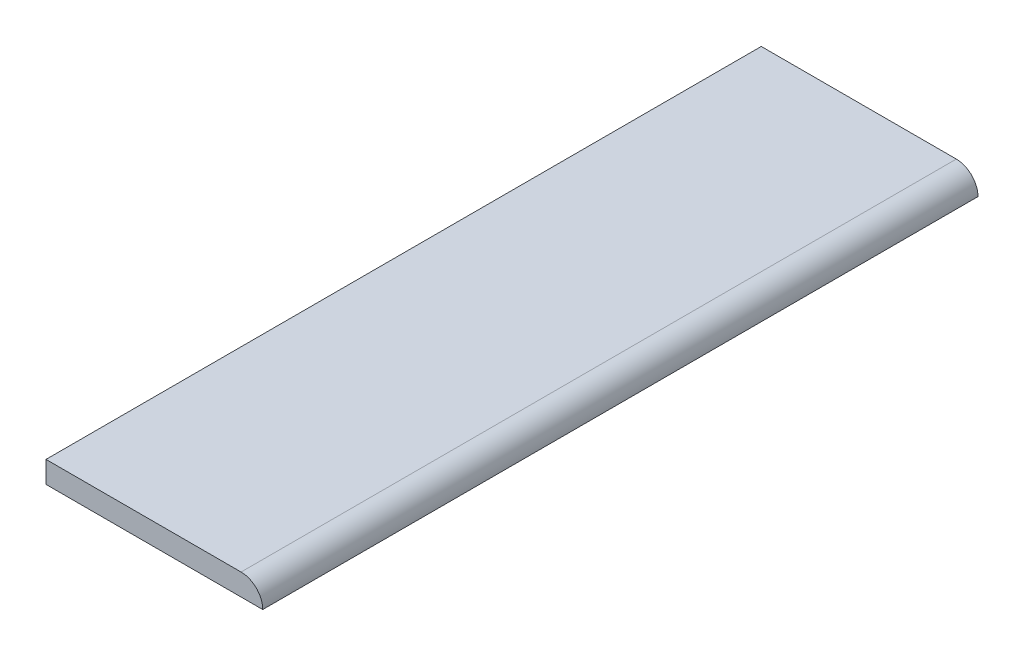
ISO-10303-21;
HEADER;
FILE_DESCRIPTION(('STEP AP214'),'2;1');
FILE_NAME('part.step','',(''),(''),'','','');
FILE_SCHEMA(('AUTOMOTIVE_DESIGN { 1 0 10303 214 1 1 1 1 }'));
ENDSEC;
DATA;
#1=APPLICATION_CONTEXT('core data for automotive mechanical design processes');
#2=APPLICATION_PROTOCOL_DEFINITION('international standard','automotive_design',2000,#1);
#3=PRODUCT_CONTEXT('',#1,'mechanical');
#4=PRODUCT('Part','Part','',(#3));
#5=PRODUCT_RELATED_PRODUCT_CATEGORY('part','',(#4));
#6=PRODUCT_DEFINITION_FORMATION('','',#4);
#7=PRODUCT_DEFINITION_CONTEXT('part definition',#1,'design');
#8=PRODUCT_DEFINITION('design','',#6,#7);
#9=PRODUCT_DEFINITION_SHAPE('','',#8);
#10=(LENGTH_UNIT() NAMED_UNIT(*) SI_UNIT(.MILLI.,.METRE.));
#11=(NAMED_UNIT(*) PLANE_ANGLE_UNIT() SI_UNIT($,.RADIAN.));
#12=(NAMED_UNIT(*) SI_UNIT($,.STERADIAN.) SOLID_ANGLE_UNIT());
#13=UNCERTAINTY_MEASURE_WITH_UNIT(LENGTH_MEASURE(1.E-05),#10,'distance_accuracy_value','');
#14=(GEOMETRIC_REPRESENTATION_CONTEXT(3) GLOBAL_UNCERTAINTY_ASSIGNED_CONTEXT((#13)) GLOBAL_UNIT_ASSIGNED_CONTEXT((#10,
#11,#12)) REPRESENTATION_CONTEXT('',''));
#15=CARTESIAN_POINT('',(0.,0.,0.));
#16=DIRECTION('',(0.,0.,1.));
#17=DIRECTION('',(1.,0.,0.));
#18=AXIS2_PLACEMENT_3D('',#15,#16,#17);
#19=CARTESIAN_POINT('',(29.29,1.62,4.05));
#20=DIRECTION('',(0.,1.,0.));
#21=DIRECTION('',(0.,0.,1.));
#22=AXIS2_PLACEMENT_3D('',#19,#20,#21);
#23=PLANE('',#22);
#24=DIRECTION('',(0.,0.,-1.));
#25=VECTOR('',#24,1.);
#26=CARTESIAN_POINT('',(29.29,1.62,5.7));
#27=LINE('',#26,#25);
#28=CARTESIAN_POINT('',(29.29,1.62,4.05));
#29=VERTEX_POINT('',#28);
#30=CARTESIAN_POINT('',(29.29,1.62,7.35));
#31=VERTEX_POINT('',#30);
#32=EDGE_CURVE('E60',#29,#31,#27,.F.);
#33=ORIENTED_EDGE('',*,*,#32,.T.);
#34=DIRECTION('',(1.,0.,0.));
#35=VECTOR('',#34,1.);
#36=CARTESIAN_POINT('',(29.29,1.62,7.35));
#37=LINE('',#36,#35);
#38=CARTESIAN_POINT('',(30.19,1.62,7.35));
#39=VERTEX_POINT('',#38);
#40=EDGE_CURVE('E83',#39,#31,#37,.F.);
#41=ORIENTED_EDGE('',*,*,#40,.F.);
#42=DIRECTION('',(0.,0.,1.));
#43=VECTOR('',#42,1.);
#44=CARTESIAN_POINT('',(30.19,1.62,4.875));
#45=LINE('',#44,#43);
#46=CARTESIAN_POINT('',(30.19,1.62,4.05));
#47=VERTEX_POINT('',#46);
#48=EDGE_CURVE('E47',#47,#39,#45,.T.);
#49=ORIENTED_EDGE('',*,*,#48,.F.);
#50=DIRECTION('',(-1.,0.,0.));
#51=VECTOR('',#50,1.);
#52=CARTESIAN_POINT('',(29.29,1.62,4.05));
#53=LINE('',#52,#51);
#54=EDGE_CURVE('E55',#29,#47,#53,.F.);
#55=ORIENTED_EDGE('',*,*,#54,.F.);
#56=EDGE_LOOP('',(#33,#41,#49,#55));
#57=FACE_BOUND('',#56,.T.);
#58=ADVANCED_FACE('F17',(#57),#23,.T.);
#59=CARTESIAN_POINT('',(29.29,1.57,5.7));
#60=DIRECTION('',(1.,0.,0.));
#61=DIRECTION('',(0.,0.,-1.));
#62=AXIS2_PLACEMENT_3D('',#59,#60,#61);
#63=PLANE('',#62);
#64=DIRECTION('',(0.,1.,0.));
#65=VECTOR('',#64,1.);
#66=CARTESIAN_POINT('',(29.29,1.62,7.35));
#67=LINE('',#66,#65);
#68=CARTESIAN_POINT('',(29.29,1.52,7.35));
#69=VERTEX_POINT('',#68);
#70=EDGE_CURVE('E66',#31,#69,#67,.F.);
#71=ORIENTED_EDGE('',*,*,#70,.F.);
#72=ORIENTED_EDGE('',*,*,#32,.F.);
#73=DIRECTION('',(0.,1.,0.));
#74=VECTOR('',#73,1.);
#75=CARTESIAN_POINT('',(29.29,1.52,4.05));
#76=LINE('',#75,#74);
#77=CARTESIAN_POINT('',(29.29,1.52,4.05));
#78=VERTEX_POINT('',#77);
#79=EDGE_CURVE('E63',#78,#29,#76,.T.);
#80=ORIENTED_EDGE('',*,*,#79,.F.);
#81=DIRECTION('',(0.,0.,-1.));
#82=VECTOR('',#81,1.);
#83=CARTESIAN_POINT('',(29.29,1.52,7.35));
#84=LINE('',#83,#82);
#85=EDGE_CURVE('E86',#69,#78,#84,.T.);
#86=ORIENTED_EDGE('',*,*,#85,.F.);
#87=EDGE_LOOP('',(#71,#72,#80,#86));
#88=FACE_BOUND('',#87,.T.);
#89=ADVANCED_FACE('F61',(#88),#63,.F.);
#90=CARTESIAN_POINT('',(29.29,1.52,4.05));
#91=DIRECTION('',(0.,0.,-1.));
#92=DIRECTION('',(-1.,0.,0.));
#93=AXIS2_PLACEMENT_3D('',#90,#91,#92);
#94=PLANE('',#93);
#95=ORIENTED_EDGE('',*,*,#79,.T.);
#96=ORIENTED_EDGE('',*,*,#54,.T.);
#97=CARTESIAN_POINT('',(30.19,1.52,4.05));
#98=DIRECTION('',(0.,0.,1.));
#99=DIRECTION('',(1.,0.,0.));
#100=AXIS2_PLACEMENT_3D('',#97,#98,#99);
#101=CIRCLE('',#100,0.1);
#102=CARTESIAN_POINT('',(30.29,1.52,4.05));
#103=VERTEX_POINT('',#102);
#104=EDGE_CURVE('E20',#103,#47,#101,.T.);
#105=ORIENTED_EDGE('',*,*,#104,.F.);
#106=DIRECTION('',(1.,0.,0.));
#107=VECTOR('',#106,1.);
#108=CARTESIAN_POINT('',(29.29,1.52,4.05));
#109=LINE('',#108,#107);
#110=EDGE_CURVE('E73',#78,#103,#109,.T.);
#111=ORIENTED_EDGE('',*,*,#110,.F.);
#112=EDGE_LOOP('',(#95,#96,#105,#111));
#113=FACE_BOUND('',#112,.T.);
#114=ADVANCED_FACE('F71',(#113),#94,.T.);
#115=CARTESIAN_POINT('',(30.19,1.52,4.875));
#116=DIRECTION('',(0.,0.,1.));
#117=DIRECTION('',(1.,0.,0.));
#118=AXIS2_PLACEMENT_3D('',#115,#116,#117);
#119=CYLINDRICAL_SURFACE('',#118,0.1);
#120=ORIENTED_EDGE('',*,*,#104,.T.);
#121=ORIENTED_EDGE('',*,*,#48,.T.);
#122=CARTESIAN_POINT('',(30.19,1.52,7.35));
#123=DIRECTION('',(0.,0.,1.));
#124=DIRECTION('',(1.,0.,0.));
#125=AXIS2_PLACEMENT_3D('',#122,#123,#124);
#126=CIRCLE('',#125,0.1);
#127=CARTESIAN_POINT('',(30.29,1.52,7.35));
#128=VERTEX_POINT('',#127);
#129=EDGE_CURVE('E35',#128,#39,#126,.T.);
#130=ORIENTED_EDGE('',*,*,#129,.F.);
#131=DIRECTION('',(0.,0.,-1.));
#132=VECTOR('',#131,1.);
#133=CARTESIAN_POINT('',(30.29,1.52,7.35));
#134=LINE('',#133,#132);
#135=EDGE_CURVE('E26',#103,#128,#134,.F.);
#136=ORIENTED_EDGE('',*,*,#135,.F.);
#137=EDGE_LOOP('',(#120,#121,#130,#136));
#138=FACE_BOUND('',#137,.T.);
#139=ADVANCED_FACE('F108',(#138),#119,.T.);
#140=CARTESIAN_POINT('',(29.29,1.62,7.35));
#141=DIRECTION('',(0.,0.,1.));
#142=DIRECTION('',(1.,0.,0.));
#143=AXIS2_PLACEMENT_3D('',#140,#141,#142);
#144=PLANE('',#143);
#145=ORIENTED_EDGE('',*,*,#70,.T.);
#146=DIRECTION('',(1.,0.,0.));
#147=VECTOR('',#146,1.);
#148=CARTESIAN_POINT('',(29.29,1.52,7.35));
#149=LINE('',#148,#147);
#150=EDGE_CURVE('E11',#128,#69,#149,.F.);
#151=ORIENTED_EDGE('',*,*,#150,.F.);
#152=ORIENTED_EDGE('',*,*,#129,.T.);
#153=ORIENTED_EDGE('',*,*,#40,.T.);
#154=EDGE_LOOP('',(#145,#151,#152,#153));
#155=FACE_BOUND('',#154,.T.);
#156=ADVANCED_FACE('F106',(#155),#144,.T.);
#157=CARTESIAN_POINT('',(29.29,1.52,7.35));
#158=DIRECTION('',(0.,-1.,0.));
#159=DIRECTION('',(0.,0.,-1.));
#160=AXIS2_PLACEMENT_3D('',#157,#158,#159);
#161=PLANE('',#160);
#162=ORIENTED_EDGE('',*,*,#135,.T.);
#163=ORIENTED_EDGE('',*,*,#150,.T.);
#164=ORIENTED_EDGE('',*,*,#85,.T.);
#165=ORIENTED_EDGE('',*,*,#110,.T.);
#166=EDGE_LOOP('',(#162,#163,#164,#165));
#167=FACE_BOUND('',#166,.T.);
#168=ADVANCED_FACE('F103',(#167),#161,.T.);
#169=CLOSED_SHELL('',(#58,#89,#114,#139,#156,#168));
#170=MANIFOLD_SOLID_BREP('B1',#169);
#171=ADVANCED_BREP_SHAPE_REPRESENTATION('',(#18,#170),#14);
#172=SHAPE_DEFINITION_REPRESENTATION(#9,#171);
ENDSEC;
END-ISO-10303-21;
